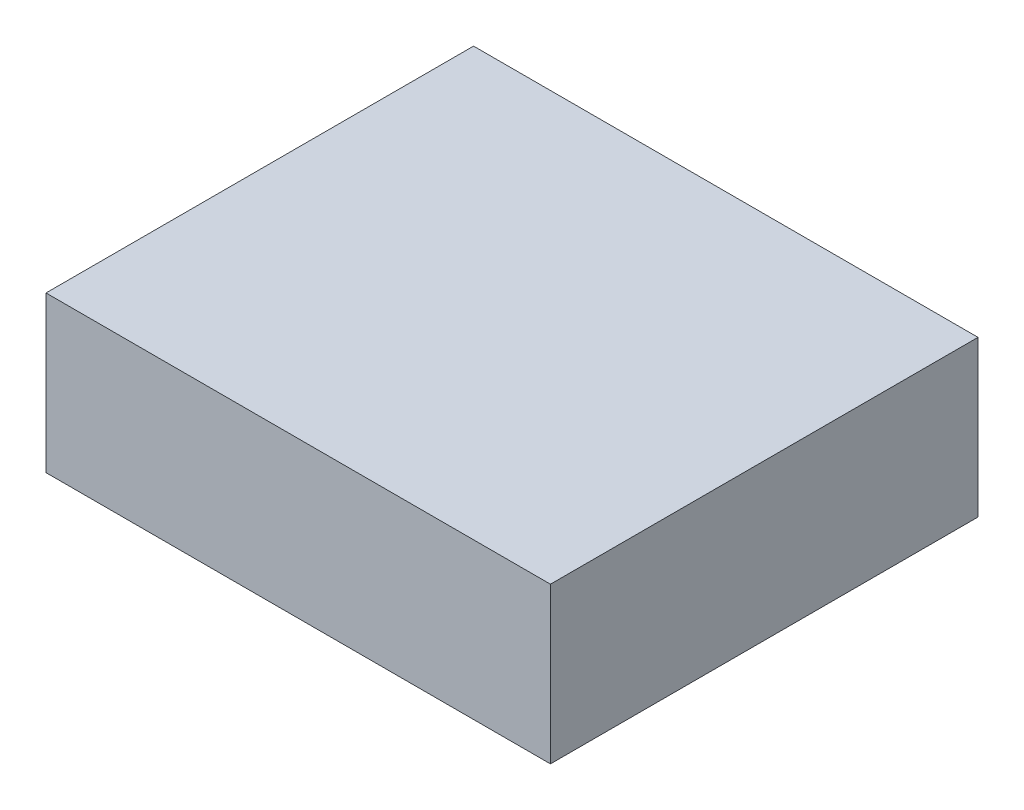
ISO-10303-21;
HEADER;
FILE_DESCRIPTION(('STEP AP214'),'2;1');
FILE_NAME('part.step','',(''),(''),'','','');
FILE_SCHEMA(('AUTOMOTIVE_DESIGN { 1 0 10303 214 1 1 1 1 }'));
ENDSEC;
DATA;
#1=APPLICATION_CONTEXT('core data for automotive mechanical design processes');
#2=APPLICATION_PROTOCOL_DEFINITION('international standard','automotive_design',2000,#1);
#3=PRODUCT_CONTEXT('',#1,'mechanical');
#4=PRODUCT('Part','Part','',(#3));
#5=PRODUCT_RELATED_PRODUCT_CATEGORY('part','',(#4));
#6=PRODUCT_DEFINITION_FORMATION('','',#4);
#7=PRODUCT_DEFINITION_CONTEXT('part definition',#1,'design');
#8=PRODUCT_DEFINITION('design','',#6,#7);
#9=PRODUCT_DEFINITION_SHAPE('','',#8);
#10=(LENGTH_UNIT() NAMED_UNIT(*) SI_UNIT(.MILLI.,.METRE.));
#11=(NAMED_UNIT(*) PLANE_ANGLE_UNIT() SI_UNIT($,.RADIAN.));
#12=(NAMED_UNIT(*) SI_UNIT($,.STERADIAN.) SOLID_ANGLE_UNIT());
#13=UNCERTAINTY_MEASURE_WITH_UNIT(LENGTH_MEASURE(1.E-05),#10,'distance_accuracy_value','');
#14=(GEOMETRIC_REPRESENTATION_CONTEXT(3) GLOBAL_UNCERTAINTY_ASSIGNED_CONTEXT((#13)) GLOBAL_UNIT_ASSIGNED_CONTEXT((#10,
#11,#12)) REPRESENTATION_CONTEXT('',''));
#15=CARTESIAN_POINT('',(0.,0.,0.));
#16=DIRECTION('',(0.,0.,1.));
#17=DIRECTION('',(1.,0.,0.));
#18=AXIS2_PLACEMENT_3D('',#15,#16,#17);
#19=CARTESIAN_POINT('',(34.163,21.082,28.956));
#20=DIRECTION('',(-1.,0.,0.));
#21=DIRECTION('',(0.,0.,1.));
#22=AXIS2_PLACEMENT_3D('',#19,#20,#21);
#23=PLANE('',#22);
#24=DIRECTION('',(0.,0.,-1.));
#25=VECTOR('',#24,1.);
#26=CARTESIAN_POINT('',(34.163,0.,28.956));
#27=LINE('',#26,#25);
#28=CARTESIAN_POINT('',(34.163,0.,28.956));
#29=VERTEX_POINT('',#28);
#30=CARTESIAN_POINT('',(34.163,0.,-28.956));
#31=VERTEX_POINT('',#30);
#32=EDGE_CURVE('E95',#29,#31,#27,.T.);
#33=ORIENTED_EDGE('',*,*,#32,.T.);
#34=DIRECTION('',(0.,-1.,0.));
#35=VECTOR('',#34,1.);
#36=CARTESIAN_POINT('',(34.163,21.082,-28.956));
#37=LINE('',#36,#35);
#38=CARTESIAN_POINT('',(34.163,21.082,-28.956));
#39=VERTEX_POINT('',#38);
#40=EDGE_CURVE('E11',#39,#31,#37,.T.);
#41=ORIENTED_EDGE('',*,*,#40,.F.);
#42=DIRECTION('',(0.,0.,-1.));
#43=VECTOR('',#42,1.);
#44=CARTESIAN_POINT('',(34.163,21.082,28.956));
#45=LINE('',#44,#43);
#46=CARTESIAN_POINT('',(34.163,21.082,28.956));
#47=VERTEX_POINT('',#46);
#48=EDGE_CURVE('E83',#47,#39,#45,.T.);
#49=ORIENTED_EDGE('',*,*,#48,.F.);
#50=DIRECTION('',(0.,-1.,0.));
#51=VECTOR('',#50,1.);
#52=CARTESIAN_POINT('',(34.163,21.082,28.956));
#53=LINE('',#52,#51);
#54=EDGE_CURVE('E91',#47,#29,#53,.T.);
#55=ORIENTED_EDGE('',*,*,#54,.T.);
#56=EDGE_LOOP('',(#33,#41,#49,#55));
#57=FACE_BOUND('',#56,.T.);
#58=ADVANCED_FACE('F32',(#57),#23,.F.);
#59=CARTESIAN_POINT('',(-34.163,21.082,-28.956));
#60=DIRECTION('',(0.,0.,1.));
#61=DIRECTION('',(1.,0.,0.));
#62=AXIS2_PLACEMENT_3D('',#59,#60,#61);
#63=PLANE('',#62);
#64=DIRECTION('',(-1.,0.,0.));
#65=VECTOR('',#64,1.);
#66=CARTESIAN_POINT('',(-34.163,0.,-28.956));
#67=LINE('',#66,#65);
#68=CARTESIAN_POINT('',(-34.163,0.,-28.956));
#69=VERTEX_POINT('',#68);
#70=EDGE_CURVE('E87',#31,#69,#67,.T.);
#71=ORIENTED_EDGE('',*,*,#70,.T.);
#72=DIRECTION('',(0.,-1.,0.));
#73=VECTOR('',#72,1.);
#74=CARTESIAN_POINT('',(-34.163,21.082,-28.956));
#75=LINE('',#74,#73);
#76=CARTESIAN_POINT('',(-34.163,21.082,-28.956));
#77=VERTEX_POINT('',#76);
#78=EDGE_CURVE('E40',#77,#69,#75,.T.);
#79=ORIENTED_EDGE('',*,*,#78,.F.);
#80=DIRECTION('',(-1.,0.,0.));
#81=VECTOR('',#80,1.);
#82=CARTESIAN_POINT('',(-34.163,21.082,-28.956));
#83=LINE('',#82,#81);
#84=EDGE_CURVE('E78',#39,#77,#83,.T.);
#85=ORIENTED_EDGE('',*,*,#84,.F.);
#86=ORIENTED_EDGE('',*,*,#40,.T.);
#87=EDGE_LOOP('',(#71,#79,#85,#86));
#88=FACE_BOUND('',#87,.T.);
#89=ADVANCED_FACE('F86',(#88),#63,.F.);
#90=CARTESIAN_POINT('',(-34.163,21.082,28.956));
#91=DIRECTION('',(1.,0.,0.));
#92=DIRECTION('',(0.,0.,-1.));
#93=AXIS2_PLACEMENT_3D('',#90,#91,#92);
#94=PLANE('',#93);
#95=DIRECTION('',(0.,0.,1.));
#96=VECTOR('',#95,1.);
#97=CARTESIAN_POINT('',(-34.163,0.,28.956));
#98=LINE('',#97,#96);
#99=CARTESIAN_POINT('',(-34.163,0.,28.956));
#100=VERTEX_POINT('',#99);
#101=EDGE_CURVE('E65',#69,#100,#98,.T.);
#102=ORIENTED_EDGE('',*,*,#101,.T.);
#103=DIRECTION('',(0.,-1.,0.));
#104=VECTOR('',#103,1.);
#105=CARTESIAN_POINT('',(-34.163,21.082,28.956));
#106=LINE('',#105,#104);
#107=CARTESIAN_POINT('',(-34.163,21.082,28.956));
#108=VERTEX_POINT('',#107);
#109=EDGE_CURVE('E88',#108,#100,#106,.T.);
#110=ORIENTED_EDGE('',*,*,#109,.F.);
#111=DIRECTION('',(0.,0.,1.));
#112=VECTOR('',#111,1.);
#113=CARTESIAN_POINT('',(-34.163,21.082,28.956));
#114=LINE('',#113,#112);
#115=EDGE_CURVE('E81',#77,#108,#114,.T.);
#116=ORIENTED_EDGE('',*,*,#115,.F.);
#117=ORIENTED_EDGE('',*,*,#78,.T.);
#118=EDGE_LOOP('',(#102,#110,#116,#117));
#119=FACE_BOUND('',#118,.T.);
#120=ADVANCED_FACE('F89',(#119),#94,.F.);
#121=CARTESIAN_POINT('',(-34.163,21.082,28.956));
#122=DIRECTION('',(0.,0.,-1.));
#123=DIRECTION('',(-1.,0.,0.));
#124=AXIS2_PLACEMENT_3D('',#121,#122,#123);
#125=PLANE('',#124);
#126=DIRECTION('',(1.,0.,0.));
#127=VECTOR('',#126,1.);
#128=CARTESIAN_POINT('',(-34.163,0.,28.956));
#129=LINE('',#128,#127);
#130=EDGE_CURVE('E71',#100,#29,#129,.T.);
#131=ORIENTED_EDGE('',*,*,#130,.T.);
#132=ORIENTED_EDGE('',*,*,#54,.F.);
#133=DIRECTION('',(1.,0.,0.));
#134=VECTOR('',#133,1.);
#135=CARTESIAN_POINT('',(-34.163,21.082,28.956));
#136=LINE('',#135,#134);
#137=EDGE_CURVE('E48',#108,#47,#136,.T.);
#138=ORIENTED_EDGE('',*,*,#137,.F.);
#139=ORIENTED_EDGE('',*,*,#109,.T.);
#140=EDGE_LOOP('',(#131,#132,#138,#139));
#141=FACE_BOUND('',#140,.T.);
#142=ADVANCED_FACE('F102',(#141),#125,.F.);
#143=CARTESIAN_POINT('',(0.,21.082,0.));
#144=DIRECTION('',(0.,-1.,0.));
#145=DIRECTION('',(0.,0.,-1.));
#146=AXIS2_PLACEMENT_3D('',#143,#144,#145);
#147=PLANE('',#146);
#148=ORIENTED_EDGE('',*,*,#48,.T.);
#149=ORIENTED_EDGE('',*,*,#84,.T.);
#150=ORIENTED_EDGE('',*,*,#115,.T.);
#151=ORIENTED_EDGE('',*,*,#137,.T.);
#152=EDGE_LOOP('',(#148,#149,#150,#151));
#153=FACE_BOUND('',#152,.T.);
#154=ADVANCED_FACE('F79',(#153),#147,.F.);
#155=CARTESIAN_POINT('',(0.,0.,0.));
#156=DIRECTION('',(0.,-1.,0.));
#157=DIRECTION('',(0.,0.,-1.));
#158=AXIS2_PLACEMENT_3D('',#155,#156,#157);
#159=PLANE('',#158);
#160=ORIENTED_EDGE('',*,*,#32,.F.);
#161=ORIENTED_EDGE('',*,*,#130,.F.);
#162=ORIENTED_EDGE('',*,*,#101,.F.);
#163=ORIENTED_EDGE('',*,*,#70,.F.);
#164=EDGE_LOOP('',(#160,#161,#162,#163));
#165=FACE_BOUND('',#164,.T.);
#166=ADVANCED_FACE('F105',(#165),#159,.T.);
#167=CLOSED_SHELL('',(#58,#89,#120,#142,#154,#166));
#168=MANIFOLD_SOLID_BREP('B2',#167);
#169=ADVANCED_BREP_SHAPE_REPRESENTATION('',(#18,#168),#14);
#170=SHAPE_DEFINITION_REPRESENTATION(#9,#169);
ENDSEC;
END-ISO-10303-21;
